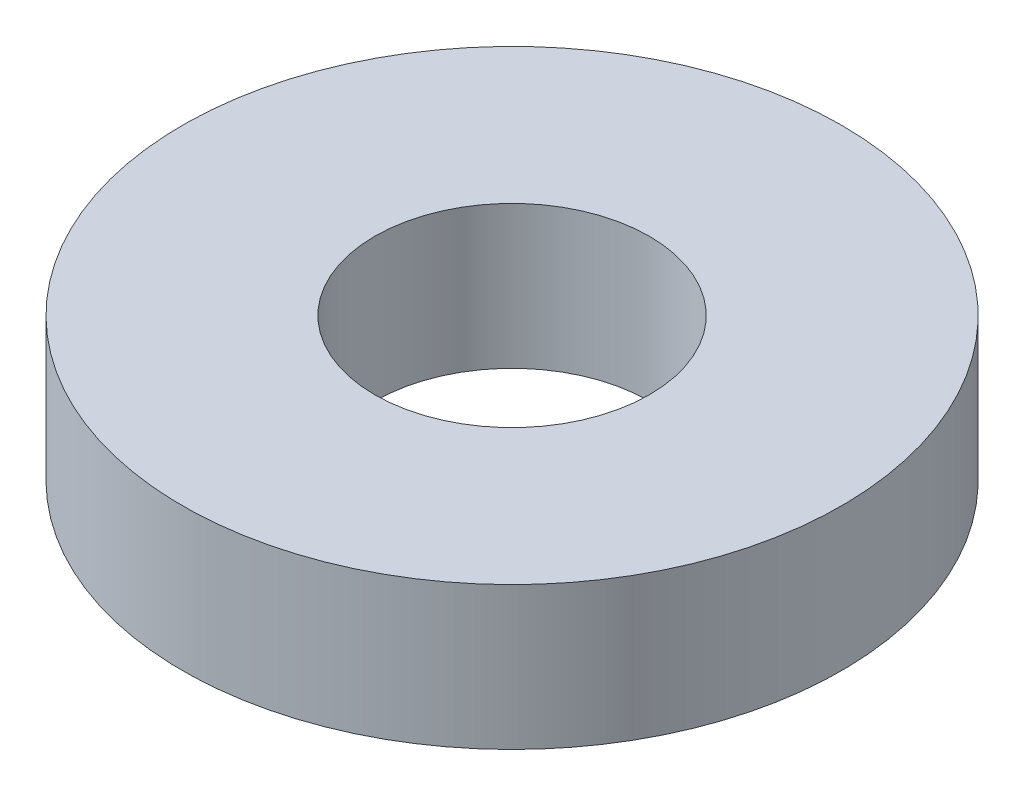
ISO-10303-21;
HEADER;
FILE_DESCRIPTION(('STEP AP214'),'2;1');
FILE_NAME('part.step','',(''),(''),'','','');
FILE_SCHEMA(('AUTOMOTIVE_DESIGN { 1 0 10303 214 1 1 1 1 }'));
ENDSEC;
DATA;
#1=APPLICATION_CONTEXT('core data for automotive mechanical design processes');
#2=APPLICATION_PROTOCOL_DEFINITION('international standard','automotive_design',2000,#1);
#3=PRODUCT_CONTEXT('',#1,'mechanical');
#4=PRODUCT('Part','Part','',(#3));
#5=PRODUCT_RELATED_PRODUCT_CATEGORY('part','',(#4));
#6=PRODUCT_DEFINITION_FORMATION('','',#4);
#7=PRODUCT_DEFINITION_CONTEXT('part definition',#1,'design');
#8=PRODUCT_DEFINITION('design','',#6,#7);
#9=PRODUCT_DEFINITION_SHAPE('','',#8);
#10=(LENGTH_UNIT() NAMED_UNIT(*) SI_UNIT(.MILLI.,.METRE.));
#11=(NAMED_UNIT(*) PLANE_ANGLE_UNIT() SI_UNIT($,.RADIAN.));
#12=(NAMED_UNIT(*) SI_UNIT($,.STERADIAN.) SOLID_ANGLE_UNIT());
#13=UNCERTAINTY_MEASURE_WITH_UNIT(LENGTH_MEASURE(1.E-05),#10,'distance_accuracy_value','');
#14=(GEOMETRIC_REPRESENTATION_CONTEXT(3) GLOBAL_UNCERTAINTY_ASSIGNED_CONTEXT((#13)) GLOBAL_UNIT_ASSIGNED_CONTEXT((#10,
#11,#12)) REPRESENTATION_CONTEXT('',''));
#15=CARTESIAN_POINT('',(0.,0.,0.));
#16=DIRECTION('',(0.,0.,1.));
#17=DIRECTION('',(1.,0.,0.));
#18=AXIS2_PLACEMENT_3D('',#15,#16,#17);
#19=CARTESIAN_POINT('',(0.,13.,0.));
#20=DIRECTION('',(0.,-1.,0.));
#21=DIRECTION('',(0.,0.,-1.));
#22=AXIS2_PLACEMENT_3D('',#19,#20,#21);
#23=CYLINDRICAL_SURFACE('',#22,30.);
#24=CARTESIAN_POINT('',(0.,13.,0.));
#25=DIRECTION('',(0.,1.,0.));
#26=DIRECTION('',(0.,0.,1.));
#27=AXIS2_PLACEMENT_3D('',#24,#25,#26);
#28=CIRCLE('',#27,30.);
#29=CARTESIAN_POINT('',(0.,13.,-30.));
#30=VERTEX_POINT('',#29);
#31=EDGE_CURVE('E10',#30,#30,#28,.T.);
#32=CARTESIAN_POINT('',(0.,0.,0.));
#33=DIRECTION('',(0.,1.,0.));
#34=DIRECTION('',(0.,0.,1.));
#35=AXIS2_PLACEMENT_3D('',#32,#33,#34);
#36=CIRCLE('',#35,30.);
#37=CARTESIAN_POINT('',(0.,0.,-30.));
#38=VERTEX_POINT('',#37);
#39=EDGE_CURVE('E37',#38,#38,#36,.T.);
#40=CARTESIAN_POINT('',(0.,13.,-30.));
#41=CARTESIAN_POINT('',(0.,12.8645833333333,-30.));
#42=CARTESIAN_POINT('',(0.,12.7291666666667,-30.));
#43=CARTESIAN_POINT('',(0.,12.4583333333333,-30.));
#44=CARTESIAN_POINT('',(0.,12.3229166666667,-30.));
#45=CARTESIAN_POINT('',(0.,12.0520833333333,-30.));
#46=CARTESIAN_POINT('',(0.,11.9166666666667,-30.));
#47=CARTESIAN_POINT('',(0.,11.6458333333333,-30.));
#48=CARTESIAN_POINT('',(0.,11.5104166666667,-30.));
#49=CARTESIAN_POINT('',(0.,11.2395833333333,-30.));
#50=CARTESIAN_POINT('',(0.,11.1041666666667,-30.));
#51=CARTESIAN_POINT('',(0.,10.8333333333333,-30.));
#52=CARTESIAN_POINT('',(0.,10.6979166666667,-30.));
#53=CARTESIAN_POINT('',(0.,10.4270833333333,-30.));
#54=CARTESIAN_POINT('',(0.,10.2916666666667,-30.));
#55=CARTESIAN_POINT('',(0.,10.0208333333333,-30.));
#56=CARTESIAN_POINT('',(0.,9.88541666666667,-30.));
#57=CARTESIAN_POINT('',(0.,9.61458333333333,-30.));
#58=CARTESIAN_POINT('',(0.,9.47916666666667,-30.));
#59=CARTESIAN_POINT('',(0.,9.20833333333333,-30.));
#60=CARTESIAN_POINT('',(0.,9.07291666666667,-30.));
#61=CARTESIAN_POINT('',(0.,8.80208333333333,-30.));
#62=CARTESIAN_POINT('',(0.,8.66666666666667,-30.));
#63=CARTESIAN_POINT('',(0.,8.39583333333333,-30.));
#64=CARTESIAN_POINT('',(0.,8.26041666666667,-30.));
#65=CARTESIAN_POINT('',(0.,7.98958333333333,-30.));
#66=CARTESIAN_POINT('',(0.,7.85416666666667,-30.));
#67=CARTESIAN_POINT('',(0.,7.58333333333333,-30.));
#68=CARTESIAN_POINT('',(0.,7.44791666666667,-30.));
#69=CARTESIAN_POINT('',(0.,7.17708333333333,-30.));
#70=CARTESIAN_POINT('',(0.,7.04166666666667,-30.));
#71=CARTESIAN_POINT('',(0.,6.77083333333333,-30.));
#72=CARTESIAN_POINT('',(0.,6.63541666666667,-30.));
#73=CARTESIAN_POINT('',(0.,6.36458333333333,-30.));
#74=CARTESIAN_POINT('',(0.,6.22916666666667,-30.));
#75=CARTESIAN_POINT('',(0.,5.95833333333333,-30.));
#76=CARTESIAN_POINT('',(0.,5.82291666666667,-30.));
#77=CARTESIAN_POINT('',(0.,5.55208333333333,-30.));
#78=CARTESIAN_POINT('',(0.,5.41666666666667,-30.));
#79=CARTESIAN_POINT('',(0.,5.14583333333333,-30.));
#80=CARTESIAN_POINT('',(0.,5.01041666666667,-30.));
#81=CARTESIAN_POINT('',(0.,4.73958333333333,-30.));
#82=CARTESIAN_POINT('',(0.,4.60416666666667,-30.));
#83=CARTESIAN_POINT('',(0.,4.33333333333333,-30.));
#84=CARTESIAN_POINT('',(0.,4.19791666666667,-30.));
#85=CARTESIAN_POINT('',(0.,3.92708333333333,-30.));
#86=CARTESIAN_POINT('',(0.,3.79166666666667,-30.));
#87=CARTESIAN_POINT('',(0.,3.52083333333333,-30.));
#88=CARTESIAN_POINT('',(0.,3.38541666666667,-30.));
#89=CARTESIAN_POINT('',(0.,3.11458333333333,-30.));
#90=CARTESIAN_POINT('',(0.,2.97916666666667,-30.));
#91=CARTESIAN_POINT('',(0.,2.70833333333333,-30.));
#92=CARTESIAN_POINT('',(0.,2.57291666666667,-30.));
#93=CARTESIAN_POINT('',(0.,2.30208333333333,-30.));
#94=CARTESIAN_POINT('',(0.,2.16666666666667,-30.));
#95=CARTESIAN_POINT('',(0.,1.89583333333333,-30.));
#96=CARTESIAN_POINT('',(0.,1.76041666666667,-30.));
#97=CARTESIAN_POINT('',(0.,1.48958333333333,-30.));
#98=CARTESIAN_POINT('',(0.,1.35416666666667,-30.));
#99=CARTESIAN_POINT('',(0.,1.08333333333333,-30.));
#100=CARTESIAN_POINT('',(0.,0.947916666666667,-30.));
#101=CARTESIAN_POINT('',(0.,0.677083333333334,-30.));
#102=CARTESIAN_POINT('',(0.,0.541666666666667,-30.));
#103=CARTESIAN_POINT('',(0.,0.270833333333334,-30.));
#104=CARTESIAN_POINT('',(0.,0.135416666666667,-30.));
#105=CARTESIAN_POINT('',(0.,0.,-30.));
#106=B_SPLINE_CURVE_WITH_KNOTS('',3,(#40,#41,#42,#43,#44,#45,#46,#47,#48,#49,#50,#51,#52,#53,
#54,#55,#56,#57,#58,#59,#60,#61,#62,#63,#64,#65,#66,#67,#68,#69,#70,#71,#72,#73,#74,#75,#76,#77,
#78,#79,#80,#81,#82,#83,#84,#85,#86,#87,#88,#89,#90,#91,#92,#93,#94,#95,#96,#97,#98,#99,#100,
#101,#102,#103,#104,#105),.UNSPECIFIED.,.F.,.F.,(4,2,2,2,2,2,2,2,2,2,2,2,2,2,2,2,2,2,2,2,2,2,2,
2,2,2,2,2,2,2,2,2,4),(0.,0.406249999999999,0.812499999999999,1.21875,1.625,2.03125,2.4375,
2.84375,3.25,3.65625,4.0625,4.46875,4.875,5.28125,5.6875,6.09375,6.5,6.90625,7.3125,7.71875,
8.125,8.53125,8.9375,9.34375,9.75,10.15625,10.5625,10.96875,11.375,11.78125,12.1875,12.59375,
13.),.UNSPECIFIED.);
#107=EDGE_CURVE('BSEAM40',#30,#38,#106,.T.);
#108=ORIENTED_EDGE('',*,*,#31,.F.);
#109=ORIENTED_EDGE('',*,*,#39,.T.);
#110=ORIENTED_EDGE('',*,*,#107,.T.);
#111=ORIENTED_EDGE('',*,*,#107,.F.);
#112=EDGE_LOOP('',(#108,#110,#109,#111));
#113=FACE_BOUND('',#112,.T.);
#114=ADVANCED_FACE('F40',(#113),#23,.T.);
#115=CARTESIAN_POINT('',(0.,13.,0.));
#116=DIRECTION('',(0.,1.,0.));
#117=DIRECTION('',(0.,0.,1.));
#118=AXIS2_PLACEMENT_3D('',#115,#116,#117);
#119=PLANE('',#118);
#120=CARTESIAN_POINT('',(0.,13.,0.));
#121=DIRECTION('',(0.,1.,0.));
#122=DIRECTION('',(0.,0.,1.));
#123=AXIS2_PLACEMENT_3D('',#120,#121,#122);
#124=CIRCLE('',#123,12.5);
#125=CARTESIAN_POINT('',(0.,13.,-12.5));
#126=VERTEX_POINT('',#125);
#127=EDGE_CURVE('E50',#126,#126,#124,.T.);
#128=ORIENTED_EDGE('',*,*,#127,.F.);
#129=EDGE_LOOP('',(#128));
#130=FACE_BOUND('',#129,.T.);
#131=ORIENTED_EDGE('',*,*,#31,.T.);
#132=EDGE_LOOP('',(#131));
#133=FACE_BOUND('',#132,.T.);
#134=ADVANCED_FACE('F59',(#130,#133),#119,.T.);
#135=CARTESIAN_POINT('',(0.,0.,0.));
#136=DIRECTION('',(0.,1.,0.));
#137=DIRECTION('',(0.,0.,1.));
#138=AXIS2_PLACEMENT_3D('',#135,#136,#137);
#139=PLANE('',#138);
#140=CARTESIAN_POINT('',(0.,0.,0.));
#141=DIRECTION('',(0.,1.,0.));
#142=DIRECTION('',(0.,0.,1.));
#143=AXIS2_PLACEMENT_3D('',#140,#141,#142);
#144=CIRCLE('',#143,12.5);
#145=CARTESIAN_POINT('',(0.,0.,-12.5));
#146=VERTEX_POINT('',#145);
#147=EDGE_CURVE('E47',#146,#146,#144,.T.);
#148=ORIENTED_EDGE('',*,*,#147,.T.);
#149=EDGE_LOOP('',(#148));
#150=FACE_BOUND('',#149,.T.);
#151=ORIENTED_EDGE('',*,*,#39,.F.);
#152=EDGE_LOOP('',(#151));
#153=FACE_BOUND('',#152,.T.);
#154=ADVANCED_FACE('F58',(#150,#153),#139,.F.);
#155=CARTESIAN_POINT('',(0.,13.,0.));
#156=DIRECTION('',(0.,-1.,0.));
#157=DIRECTION('',(0.,0.,-1.));
#158=AXIS2_PLACEMENT_3D('',#155,#156,#157);
#159=CYLINDRICAL_SURFACE('',#158,12.5);
#160=CARTESIAN_POINT('',(0.,13.,-12.5));
#161=CARTESIAN_POINT('',(0.,12.8645833333333,-12.5));
#162=CARTESIAN_POINT('',(0.,12.7291666666667,-12.5));
#163=CARTESIAN_POINT('',(0.,12.4583333333333,-12.5));
#164=CARTESIAN_POINT('',(0.,12.3229166666667,-12.5));
#165=CARTESIAN_POINT('',(0.,12.0520833333333,-12.5));
#166=CARTESIAN_POINT('',(0.,11.9166666666667,-12.5));
#167=CARTESIAN_POINT('',(0.,11.6458333333333,-12.5));
#168=CARTESIAN_POINT('',(0.,11.5104166666667,-12.5));
#169=CARTESIAN_POINT('',(0.,11.2395833333333,-12.5));
#170=CARTESIAN_POINT('',(0.,11.1041666666667,-12.5));
#171=CARTESIAN_POINT('',(0.,10.8333333333333,-12.5));
#172=CARTESIAN_POINT('',(0.,10.6979166666667,-12.5));
#173=CARTESIAN_POINT('',(0.,10.4270833333333,-12.5));
#174=CARTESIAN_POINT('',(0.,10.2916666666667,-12.5));
#175=CARTESIAN_POINT('',(0.,10.0208333333333,-12.5));
#176=CARTESIAN_POINT('',(0.,9.88541666666667,-12.5));
#177=CARTESIAN_POINT('',(0.,9.61458333333333,-12.5));
#178=CARTESIAN_POINT('',(0.,9.47916666666667,-12.5));
#179=CARTESIAN_POINT('',(0.,9.20833333333333,-12.5));
#180=CARTESIAN_POINT('',(0.,9.07291666666666,-12.5));
#181=CARTESIAN_POINT('',(0.,8.80208333333333,-12.5));
#182=CARTESIAN_POINT('',(0.,8.66666666666667,-12.5));
#183=CARTESIAN_POINT('',(0.,8.39583333333333,-12.5));
#184=CARTESIAN_POINT('',(0.,8.26041666666667,-12.5));
#185=CARTESIAN_POINT('',(0.,7.98958333333333,-12.5));
#186=CARTESIAN_POINT('',(0.,7.85416666666667,-12.5));
#187=CARTESIAN_POINT('',(0.,7.58333333333333,-12.5));
#188=CARTESIAN_POINT('',(0.,7.44791666666667,-12.5));
#189=CARTESIAN_POINT('',(0.,7.17708333333333,-12.5));
#190=CARTESIAN_POINT('',(0.,7.04166666666667,-12.5));
#191=CARTESIAN_POINT('',(0.,6.77083333333333,-12.5));
#192=CARTESIAN_POINT('',(0.,6.63541666666667,-12.5));
#193=CARTESIAN_POINT('',(0.,6.36458333333333,-12.5));
#194=CARTESIAN_POINT('',(0.,6.22916666666667,-12.5));
#195=CARTESIAN_POINT('',(0.,5.95833333333333,-12.5));
#196=CARTESIAN_POINT('',(0.,5.82291666666667,-12.5));
#197=CARTESIAN_POINT('',(0.,5.55208333333333,-12.5));
#198=CARTESIAN_POINT('',(0.,5.41666666666667,-12.5));
#199=CARTESIAN_POINT('',(0.,5.14583333333333,-12.5));
#200=CARTESIAN_POINT('',(0.,5.01041666666667,-12.5));
#201=CARTESIAN_POINT('',(0.,4.73958333333333,-12.5));
#202=CARTESIAN_POINT('',(0.,4.60416666666667,-12.5));
#203=CARTESIAN_POINT('',(0.,4.33333333333333,-12.5));
#204=CARTESIAN_POINT('',(0.,4.19791666666667,-12.5));
#205=CARTESIAN_POINT('',(0.,3.92708333333333,-12.5));
#206=CARTESIAN_POINT('',(0.,3.79166666666667,-12.5));
#207=CARTESIAN_POINT('',(0.,3.52083333333333,-12.5));
#208=CARTESIAN_POINT('',(0.,3.38541666666667,-12.5));
#209=CARTESIAN_POINT('',(0.,3.11458333333333,-12.5));
#210=CARTESIAN_POINT('',(0.,2.97916666666667,-12.5));
#211=CARTESIAN_POINT('',(0.,2.70833333333333,-12.5));
#212=CARTESIAN_POINT('',(0.,2.57291666666667,-12.5));
#213=CARTESIAN_POINT('',(0.,2.30208333333333,-12.5));
#214=CARTESIAN_POINT('',(0.,2.16666666666667,-12.5));
#215=CARTESIAN_POINT('',(0.,1.89583333333333,-12.5));
#216=CARTESIAN_POINT('',(0.,1.76041666666667,-12.5));
#217=CARTESIAN_POINT('',(0.,1.48958333333333,-12.5));
#218=CARTESIAN_POINT('',(0.,1.35416666666667,-12.5));
#219=CARTESIAN_POINT('',(0.,1.08333333333333,-12.5));
#220=CARTESIAN_POINT('',(0.,0.947916666666667,-12.5));
#221=CARTESIAN_POINT('',(0.,0.677083333333334,-12.5));
#222=CARTESIAN_POINT('',(0.,0.541666666666667,-12.5));
#223=CARTESIAN_POINT('',(0.,0.270833333333334,-12.5));
#224=CARTESIAN_POINT('',(0.,0.135416666666667,-12.5));
#225=CARTESIAN_POINT('',(0.,0.,-12.5));
#226=B_SPLINE_CURVE_WITH_KNOTS('',3,(#160,#161,#162,#163,#164,#165,#166,#167,#168,#169,#170,
#171,#172,#173,#174,#175,#176,#177,#178,#179,#180,#181,#182,#183,#184,#185,#186,#187,#188,#189,
#190,#191,#192,#193,#194,#195,#196,#197,#198,#199,#200,#201,#202,#203,#204,#205,#206,#207,#208,
#209,#210,#211,#212,#213,#214,#215,#216,#217,#218,#219,#220,#221,#222,#223,#224,#225),
.UNSPECIFIED.,.F.,.F.,(4,2,2,2,2,2,2,2,2,2,2,2,2,2,2,2,2,2,2,2,2,2,2,2,2,2,2,2,2,2,2,2,4),(0.,
0.40625,0.812500000000001,1.21875,1.625,2.03125,2.4375,2.84375,3.25,3.65625,4.0625,4.46875,
4.875,5.28125,5.6875,6.09375,6.5,6.90625,7.3125,7.71875,8.125,8.53125,8.9375,9.34375,9.75,
10.15625,10.5625,10.96875,11.375,11.78125,12.1875,12.59375,13.),.UNSPECIFIED.);
#227=EDGE_CURVE('BSEAM54',#126,#146,#226,.T.);
#228=ORIENTED_EDGE('',*,*,#127,.T.);
#229=ORIENTED_EDGE('',*,*,#147,.F.);
#230=ORIENTED_EDGE('',*,*,#227,.T.);
#231=ORIENTED_EDGE('',*,*,#227,.F.);
#232=EDGE_LOOP('',(#228,#230,#229,#231));
#233=FACE_BOUND('',#232,.T.);
#234=ADVANCED_FACE('F54',(#233),#159,.F.);
#235=CLOSED_SHELL('',(#114,#134,#154,#234));
#236=MANIFOLD_SOLID_BREP('B2',#235);
#237=ADVANCED_BREP_SHAPE_REPRESENTATION('',(#18,#236),#14);
#238=SHAPE_DEFINITION_REPRESENTATION(#9,#237);
ENDSEC;
END-ISO-10303-21;
